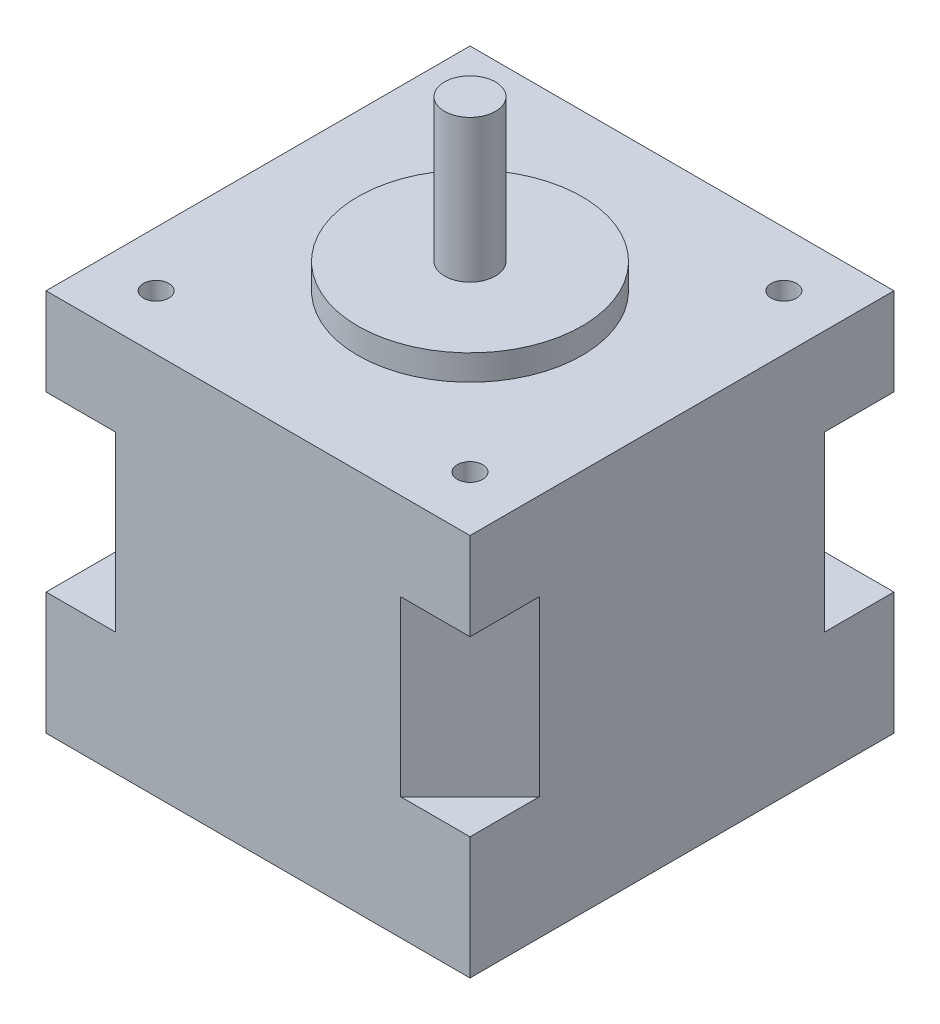
ISO-10303-21;
HEADER;
FILE_DESCRIPTION(('STEP AP214'),'2;1');
FILE_NAME('part.step','',(''),(''),'','','');
FILE_SCHEMA(('AUTOMOTIVE_DESIGN { 1 0 10303 214 1 1 1 1 }'));
ENDSEC;
DATA;
#1=APPLICATION_CONTEXT('core data for automotive mechanical design processes');
#2=APPLICATION_PROTOCOL_DEFINITION('international standard','automotive_design',2000,#1);
#3=PRODUCT_CONTEXT('',#1,'mechanical');
#4=PRODUCT('Part','Part','',(#3));
#5=PRODUCT_RELATED_PRODUCT_CATEGORY('part','',(#4));
#6=PRODUCT_DEFINITION_FORMATION('','',#4);
#7=PRODUCT_DEFINITION_CONTEXT('part definition',#1,'design');
#8=PRODUCT_DEFINITION('design','',#6,#7);
#9=PRODUCT_DEFINITION_SHAPE('','',#8);
#10=(LENGTH_UNIT() NAMED_UNIT(*) SI_UNIT(.MILLI.,.METRE.));
#11=(NAMED_UNIT(*) PLANE_ANGLE_UNIT() SI_UNIT($,.RADIAN.));
#12=(NAMED_UNIT(*) SI_UNIT($,.STERADIAN.) SOLID_ANGLE_UNIT());
#13=UNCERTAINTY_MEASURE_WITH_UNIT(LENGTH_MEASURE(1.E-05),#10,'distance_accuracy_value','');
#14=(GEOMETRIC_REPRESENTATION_CONTEXT(3) GLOBAL_UNCERTAINTY_ASSIGNED_CONTEXT((#13)) GLOBAL_UNIT_ASSIGNED_CONTEXT((#10,
#11,#12)) REPRESENTATION_CONTEXT('',''));
#15=CARTESIAN_POINT('',(0.,0.,0.));
#16=DIRECTION('',(0.,0.,1.));
#17=DIRECTION('',(1.,0.,0.));
#18=AXIS2_PLACEMENT_3D('',#15,#16,#17);
#19=CARTESIAN_POINT('',(20.8,37.6,-20.8));
#20=DIRECTION('',(-1.,0.,0.));
#21=DIRECTION('',(0.,0.,1.));
#22=AXIS2_PLACEMENT_3D('',#19,#20,#21);
#23=PLANE('',#22);
#24=DIRECTION('',(0.,-1.,0.));
#25=VECTOR('',#24,1.);
#26=CARTESIAN_POINT('',(20.8,37.6,20.8));
#27=LINE('',#26,#25);
#28=CARTESIAN_POINT('',(20.8,37.6,20.8));
#29=VERTEX_POINT('',#28);
#30=CARTESIAN_POINT('',(20.8,29.,20.8));
#31=VERTEX_POINT('',#30);
#32=EDGE_CURVE('E185',#29,#31,#27,.T.);
#33=ORIENTED_EDGE('',*,*,#32,.T.);
#34=DIRECTION('',(0.,0.,-1.));
#35=VECTOR('',#34,1.);
#36=CARTESIAN_POINT('',(20.8,29.,20.8));
#37=LINE('',#36,#35);
#38=CARTESIAN_POINT('',(20.8,29.,14.));
#39=VERTEX_POINT('',#38);
#40=EDGE_CURVE('E271',#31,#39,#37,.T.);
#41=ORIENTED_EDGE('',*,*,#40,.T.);
#42=DIRECTION('',(0.,-1.,0.));
#43=VECTOR('',#42,1.);
#44=CARTESIAN_POINT('',(20.8,29.,14.));
#45=LINE('',#44,#43);
#46=CARTESIAN_POINT('',(20.8,12.,14.));
#47=VERTEX_POINT('',#46);
#48=EDGE_CURVE('E256',#39,#47,#45,.T.);
#49=ORIENTED_EDGE('',*,*,#48,.T.);
#50=DIRECTION('',(0.,0.,-1.));
#51=VECTOR('',#50,1.);
#52=CARTESIAN_POINT('',(20.8,12.,20.8));
#53=LINE('',#52,#51);
#54=CARTESIAN_POINT('',(20.8,12.,20.8));
#55=VERTEX_POINT('',#54);
#56=EDGE_CURVE('E274',#55,#47,#53,.T.);
#57=ORIENTED_EDGE('',*,*,#56,.F.);
#58=CARTESIAN_POINT('',(20.8,0.,20.8));
#59=VERTEX_POINT('',#58);
#60=EDGE_CURVE('E188',#55,#59,#27,.T.);
#61=ORIENTED_EDGE('',*,*,#60,.T.);
#62=DIRECTION('',(0.,0.,-1.));
#63=VECTOR('',#62,1.);
#64=CARTESIAN_POINT('',(20.8,0.,-20.8));
#65=LINE('',#64,#63);
#66=CARTESIAN_POINT('',(20.8,0.,-20.8));
#67=VERTEX_POINT('',#66);
#68=EDGE_CURVE('E199',#59,#67,#65,.T.);
#69=ORIENTED_EDGE('',*,*,#68,.T.);
#70=DIRECTION('',(0.,-1.,0.));
#71=VECTOR('',#70,1.);
#72=CARTESIAN_POINT('',(20.8,37.6,-20.8));
#73=LINE('',#72,#71);
#74=CARTESIAN_POINT('',(20.8,12.,-20.8));
#75=VERTEX_POINT('',#74);
#76=EDGE_CURVE('E178',#75,#67,#73,.T.);
#77=ORIENTED_EDGE('',*,*,#76,.F.);
#78=DIRECTION('',(0.,0.,1.));
#79=VECTOR('',#78,1.);
#80=CARTESIAN_POINT('',(20.8,12.,-20.8));
#81=LINE('',#80,#79);
#82=CARTESIAN_POINT('',(20.8,12.,-14.));
#83=VERTEX_POINT('',#82);
#84=EDGE_CURVE('E253',#75,#83,#81,.T.);
#85=ORIENTED_EDGE('',*,*,#84,.T.);
#86=DIRECTION('',(0.,-1.,0.));
#87=VECTOR('',#86,1.);
#88=CARTESIAN_POINT('',(20.8,29.,-14.));
#89=LINE('',#88,#87);
#90=CARTESIAN_POINT('',(20.8,29.,-14.));
#91=VERTEX_POINT('',#90);
#92=EDGE_CURVE('E242',#91,#83,#89,.T.);
#93=ORIENTED_EDGE('',*,*,#92,.F.);
#94=DIRECTION('',(0.,0.,1.));
#95=VECTOR('',#94,1.);
#96=CARTESIAN_POINT('',(20.8,29.,-20.8));
#97=LINE('',#96,#95);
#98=CARTESIAN_POINT('',(20.8,29.,-20.8));
#99=VERTEX_POINT('',#98);
#100=EDGE_CURVE('E250',#99,#91,#97,.T.);
#101=ORIENTED_EDGE('',*,*,#100,.F.);
#102=CARTESIAN_POINT('',(20.8,37.6,-20.8));
#103=VERTEX_POINT('',#102);
#104=EDGE_CURVE('E41',#103,#99,#73,.T.);
#105=ORIENTED_EDGE('',*,*,#104,.F.);
#106=DIRECTION('',(0.,0.,-1.));
#107=VECTOR('',#106,1.);
#108=CARTESIAN_POINT('',(20.8,37.6,-20.8));
#109=LINE('',#108,#107);
#110=EDGE_CURVE('E192',#29,#103,#109,.T.);
#111=ORIENTED_EDGE('',*,*,#110,.F.);
#112=EDGE_LOOP('',(#33,#41,#49,#57,#61,#69,#77,#85,#93,#101,#105,#111));
#113=FACE_BOUND('',#112,.T.);
#114=ADVANCED_FACE('F38',(#113),#23,.F.);
#115=CARTESIAN_POINT('',(-20.8,37.6,-20.8));
#116=DIRECTION('',(0.,0.,1.));
#117=DIRECTION('',(1.,0.,0.));
#118=AXIS2_PLACEMENT_3D('',#115,#116,#117);
#119=PLANE('',#118);
#120=DIRECTION('',(0.,-1.,0.));
#121=VECTOR('',#120,1.);
#122=CARTESIAN_POINT('',(-14.,29.,-20.8));
#123=LINE('',#122,#121);
#124=CARTESIAN_POINT('',(-14.,29.,-20.8));
#125=VERTEX_POINT('',#124);
#126=CARTESIAN_POINT('',(-14.,12.,-20.8));
#127=VERTEX_POINT('',#126);
#128=EDGE_CURVE('E173',#125,#127,#123,.T.);
#129=ORIENTED_EDGE('',*,*,#128,.F.);
#130=DIRECTION('',(-1.,0.,0.));
#131=VECTOR('',#130,1.);
#132=CARTESIAN_POINT('',(-14.,29.,-20.8));
#133=LINE('',#132,#131);
#134=CARTESIAN_POINT('',(-20.8,29.,-20.8));
#135=VERTEX_POINT('',#134);
#136=EDGE_CURVE('E158',#125,#135,#133,.T.);
#137=ORIENTED_EDGE('',*,*,#136,.T.);
#138=DIRECTION('',(0.,-1.,0.));
#139=VECTOR('',#138,1.);
#140=CARTESIAN_POINT('',(-20.8,37.6,-20.8));
#141=LINE('',#140,#139);
#142=CARTESIAN_POINT('',(-20.8,37.6,-20.8));
#143=VERTEX_POINT('',#142);
#144=EDGE_CURVE('E170',#143,#135,#141,.T.);
#145=ORIENTED_EDGE('',*,*,#144,.F.);
#146=DIRECTION('',(-1.,0.,0.));
#147=VECTOR('',#146,1.);
#148=CARTESIAN_POINT('',(-20.8,37.6,-20.8));
#149=LINE('',#148,#147);
#150=EDGE_CURVE('E206',#103,#143,#149,.T.);
#151=ORIENTED_EDGE('',*,*,#150,.F.);
#152=ORIENTED_EDGE('',*,*,#104,.T.);
#153=DIRECTION('',(1.,0.,0.));
#154=VECTOR('',#153,1.);
#155=CARTESIAN_POINT('',(14.,29.,-20.8));
#156=LINE('',#155,#154);
#157=CARTESIAN_POINT('',(14.,29.,-20.8));
#158=VERTEX_POINT('',#157);
#159=EDGE_CURVE('E244',#158,#99,#156,.T.);
#160=ORIENTED_EDGE('',*,*,#159,.F.);
#161=DIRECTION('',(0.,-1.,0.));
#162=VECTOR('',#161,1.);
#163=CARTESIAN_POINT('',(14.,29.,-20.8));
#164=LINE('',#163,#162);
#165=CARTESIAN_POINT('',(14.,12.,-20.8));
#166=VERTEX_POINT('',#165);
#167=EDGE_CURVE('E239',#158,#166,#164,.T.);
#168=ORIENTED_EDGE('',*,*,#167,.T.);
#169=DIRECTION('',(1.,0.,0.));
#170=VECTOR('',#169,1.);
#171=CARTESIAN_POINT('',(14.,12.,-20.8));
#172=LINE('',#171,#170);
#173=EDGE_CURVE('E247',#166,#75,#172,.T.);
#174=ORIENTED_EDGE('',*,*,#173,.T.);
#175=ORIENTED_EDGE('',*,*,#76,.T.);
#176=DIRECTION('',(-1.,0.,0.));
#177=VECTOR('',#176,1.);
#178=CARTESIAN_POINT('',(-20.8,0.,-20.8));
#179=LINE('',#178,#177);
#180=CARTESIAN_POINT('',(-20.8,0.,-20.8));
#181=VERTEX_POINT('',#180);
#182=EDGE_CURVE('E196',#67,#181,#179,.T.);
#183=ORIENTED_EDGE('',*,*,#182,.T.);
#184=CARTESIAN_POINT('',(-20.8,12.,-20.8));
#185=VERTEX_POINT('',#184);
#186=EDGE_CURVE('E179',#185,#181,#141,.T.);
#187=ORIENTED_EDGE('',*,*,#186,.F.);
#188=DIRECTION('',(-1.,0.,0.));
#189=VECTOR('',#188,1.);
#190=CARTESIAN_POINT('',(-14.,12.,-20.8));
#191=LINE('',#190,#189);
#192=EDGE_CURVE('E54',#127,#185,#191,.T.);
#193=ORIENTED_EDGE('',*,*,#192,.F.);
#194=EDGE_LOOP('',(#129,#137,#145,#151,#152,#160,#168,#174,#175,#183,#187,#193));
#195=FACE_BOUND('',#194,.T.);
#196=ADVANCED_FACE('F169',(#195),#119,.F.);
#197=CARTESIAN_POINT('',(-20.8,37.6,-20.8));
#198=DIRECTION('',(1.,0.,0.));
#199=DIRECTION('',(0.,0.,-1.));
#200=AXIS2_PLACEMENT_3D('',#197,#198,#199);
#201=PLANE('',#200);
#202=ORIENTED_EDGE('',*,*,#144,.T.);
#203=DIRECTION('',(0.,0.,1.));
#204=VECTOR('',#203,1.);
#205=CARTESIAN_POINT('',(-20.8,29.,-20.8));
#206=LINE('',#205,#204);
#207=CARTESIAN_POINT('',(-20.8,29.,-14.));
#208=VERTEX_POINT('',#207);
#209=EDGE_CURVE('E155',#135,#208,#206,.T.);
#210=ORIENTED_EDGE('',*,*,#209,.T.);
#211=DIRECTION('',(0.,-1.,0.));
#212=VECTOR('',#211,1.);
#213=CARTESIAN_POINT('',(-20.8,29.,-14.));
#214=LINE('',#213,#212);
#215=CARTESIAN_POINT('',(-20.8,12.,-14.));
#216=VERTEX_POINT('',#215);
#217=EDGE_CURVE('E295',#208,#216,#214,.T.);
#218=ORIENTED_EDGE('',*,*,#217,.T.);
#219=DIRECTION('',(0.,0.,1.));
#220=VECTOR('',#219,1.);
#221=CARTESIAN_POINT('',(-20.8,12.,-20.8));
#222=LINE('',#221,#220);
#223=EDGE_CURVE('E306',#185,#216,#222,.T.);
#224=ORIENTED_EDGE('',*,*,#223,.F.);
#225=ORIENTED_EDGE('',*,*,#186,.T.);
#226=DIRECTION('',(0.,0.,1.));
#227=VECTOR('',#226,1.);
#228=CARTESIAN_POINT('',(-20.8,0.,-20.8));
#229=LINE('',#228,#227);
#230=CARTESIAN_POINT('',(-20.8,0.,20.8));
#231=VERTEX_POINT('',#230);
#232=EDGE_CURVE('E193',#181,#231,#229,.T.);
#233=ORIENTED_EDGE('',*,*,#232,.T.);
#234=DIRECTION('',(0.,-1.,0.));
#235=VECTOR('',#234,1.);
#236=CARTESIAN_POINT('',(-20.8,37.6,20.8));
#237=LINE('',#236,#235);
#238=CARTESIAN_POINT('',(-20.8,12.,20.8));
#239=VERTEX_POINT('',#238);
#240=EDGE_CURVE('E184',#239,#231,#237,.T.);
#241=ORIENTED_EDGE('',*,*,#240,.F.);
#242=DIRECTION('',(0.,0.,-1.));
#243=VECTOR('',#242,1.);
#244=CARTESIAN_POINT('',(-20.8,12.,20.8));
#245=LINE('',#244,#243);
#246=CARTESIAN_POINT('',(-20.8,12.,14.));
#247=VERTEX_POINT('',#246);
#248=EDGE_CURVE('E62',#239,#247,#245,.T.);
#249=ORIENTED_EDGE('',*,*,#248,.T.);
#250=DIRECTION('',(0.,-1.,0.));
#251=VECTOR('',#250,1.);
#252=CARTESIAN_POINT('',(-20.8,29.,14.));
#253=LINE('',#252,#251);
#254=CARTESIAN_POINT('',(-20.8,29.,14.));
#255=VERTEX_POINT('',#254);
#256=EDGE_CURVE('E284',#255,#247,#253,.T.);
#257=ORIENTED_EDGE('',*,*,#256,.F.);
#258=DIRECTION('',(0.,0.,-1.));
#259=VECTOR('',#258,1.);
#260=CARTESIAN_POINT('',(-20.8,29.,20.8));
#261=LINE('',#260,#259);
#262=CARTESIAN_POINT('',(-20.8,29.,20.8));
#263=VERTEX_POINT('',#262);
#264=EDGE_CURVE('E291',#263,#255,#261,.T.);
#265=ORIENTED_EDGE('',*,*,#264,.F.);
#266=CARTESIAN_POINT('',(-20.8,37.6,20.8));
#267=VERTEX_POINT('',#266);
#268=EDGE_CURVE('E180',#267,#263,#237,.T.);
#269=ORIENTED_EDGE('',*,*,#268,.F.);
#270=DIRECTION('',(0.,0.,1.));
#271=VECTOR('',#270,1.);
#272=CARTESIAN_POINT('',(-20.8,37.6,-20.8));
#273=LINE('',#272,#271);
#274=EDGE_CURVE('E177',#143,#267,#273,.T.);
#275=ORIENTED_EDGE('',*,*,#274,.F.);
#276=EDGE_LOOP('',(#202,#210,#218,#224,#225,#233,#241,#249,#257,#265,#269,#275));
#277=FACE_BOUND('',#276,.T.);
#278=ADVANCED_FACE('F175',(#277),#201,.F.);
#279=CARTESIAN_POINT('',(-20.8,37.6,20.8));
#280=DIRECTION('',(0.,0.,-1.));
#281=DIRECTION('',(-1.,0.,0.));
#282=AXIS2_PLACEMENT_3D('',#279,#280,#281);
#283=PLANE('',#282);
#284=ORIENTED_EDGE('',*,*,#268,.T.);
#285=DIRECTION('',(-1.,0.,0.));
#286=VECTOR('',#285,1.);
#287=CARTESIAN_POINT('',(-14.,29.,20.8));
#288=LINE('',#287,#286);
#289=CARTESIAN_POINT('',(-14.,29.,20.8));
#290=VERTEX_POINT('',#289);
#291=EDGE_CURVE('E286',#290,#263,#288,.T.);
#292=ORIENTED_EDGE('',*,*,#291,.F.);
#293=DIRECTION('',(0.,-1.,0.));
#294=VECTOR('',#293,1.);
#295=CARTESIAN_POINT('',(-14.,29.,20.8));
#296=LINE('',#295,#294);
#297=CARTESIAN_POINT('',(-14.,12.,20.8));
#298=VERTEX_POINT('',#297);
#299=EDGE_CURVE('E277',#290,#298,#296,.T.);
#300=ORIENTED_EDGE('',*,*,#299,.T.);
#301=DIRECTION('',(-1.,0.,0.));
#302=VECTOR('',#301,1.);
#303=CARTESIAN_POINT('',(-14.,12.,20.8));
#304=LINE('',#303,#302);
#305=EDGE_CURVE('E289',#298,#239,#304,.T.);
#306=ORIENTED_EDGE('',*,*,#305,.T.);
#307=ORIENTED_EDGE('',*,*,#240,.T.);
#308=DIRECTION('',(1.,0.,0.));
#309=VECTOR('',#308,1.);
#310=CARTESIAN_POINT('',(-20.8,0.,20.8));
#311=LINE('',#310,#309);
#312=EDGE_CURVE('E189',#231,#59,#311,.T.);
#313=ORIENTED_EDGE('',*,*,#312,.T.);
#314=ORIENTED_EDGE('',*,*,#60,.F.);
#315=DIRECTION('',(1.,0.,0.));
#316=VECTOR('',#315,1.);
#317=CARTESIAN_POINT('',(14.,12.,20.8));
#318=LINE('',#317,#316);
#319=CARTESIAN_POINT('',(14.,12.,20.8));
#320=VERTEX_POINT('',#319);
#321=EDGE_CURVE('E272',#320,#55,#318,.T.);
#322=ORIENTED_EDGE('',*,*,#321,.F.);
#323=DIRECTION('',(0.,-1.,0.));
#324=VECTOR('',#323,1.);
#325=CARTESIAN_POINT('',(14.,29.,20.8));
#326=LINE('',#325,#324);
#327=CARTESIAN_POINT('',(14.,29.,20.8));
#328=VERTEX_POINT('',#327);
#329=EDGE_CURVE('E263',#328,#320,#326,.T.);
#330=ORIENTED_EDGE('',*,*,#329,.F.);
#331=DIRECTION('',(1.,0.,0.));
#332=VECTOR('',#331,1.);
#333=CARTESIAN_POINT('',(14.,29.,20.8));
#334=LINE('',#333,#332);
#335=EDGE_CURVE('E279',#328,#31,#334,.T.);
#336=ORIENTED_EDGE('',*,*,#335,.T.);
#337=ORIENTED_EDGE('',*,*,#32,.F.);
#338=DIRECTION('',(1.,0.,0.));
#339=VECTOR('',#338,1.);
#340=CARTESIAN_POINT('',(-20.8,37.6,20.8));
#341=LINE('',#340,#339);
#342=EDGE_CURVE('E203',#267,#29,#341,.T.);
#343=ORIENTED_EDGE('',*,*,#342,.F.);
#344=EDGE_LOOP('',(#284,#292,#300,#306,#307,#313,#314,#322,#330,#336,#337,#343));
#345=FACE_BOUND('',#344,.T.);
#346=ADVANCED_FACE('F341',(#345),#283,.F.);
#347=CARTESIAN_POINT('',(0.,37.6,0.));
#348=DIRECTION('',(0.,1.,0.));
#349=DIRECTION('',(0.,0.,1.));
#350=AXIS2_PLACEMENT_3D('',#347,#348,#349);
#351=PLANE('',#350);
#352=CARTESIAN_POINT('',(15.4,37.6,15.4));
#353=DIRECTION('',(0.,-1.,0.));
#354=DIRECTION('',(0.,0.,-1.));
#355=AXIS2_PLACEMENT_3D('',#352,#353,#354);
#356=CIRCLE('',#355,1.25);
#357=CARTESIAN_POINT('',(15.4,37.6,14.15));
#358=VERTEX_POINT('',#357);
#359=EDGE_CURVE('E236',#358,#358,#356,.T.);
#360=ORIENTED_EDGE('',*,*,#359,.T.);
#361=EDGE_LOOP('',(#360));
#362=FACE_BOUND('',#361,.T.);
#363=CARTESIAN_POINT('',(-15.4,37.6,15.4));
#364=DIRECTION('',(0.,1.,0.));
#365=DIRECTION('',(0.,0.,-1.));
#366=AXIS2_PLACEMENT_3D('',#363,#364,#365);
#367=CIRCLE('',#366,1.25);
#368=CARTESIAN_POINT('',(-15.4,37.6,14.15));
#369=VERTEX_POINT('',#368);
#370=EDGE_CURVE('E230',#369,#369,#367,.T.);
#371=ORIENTED_EDGE('',*,*,#370,.F.);
#372=EDGE_LOOP('',(#371));
#373=FACE_BOUND('',#372,.T.);
#374=CARTESIAN_POINT('',(-15.4,37.6,-15.4));
#375=DIRECTION('',(0.,-1.,0.));
#376=DIRECTION('',(0.,0.,1.));
#377=AXIS2_PLACEMENT_3D('',#374,#375,#376);
#378=CIRCLE('',#377,1.25);
#379=CARTESIAN_POINT('',(-15.4,37.6,-14.15));
#380=VERTEX_POINT('',#379);
#381=EDGE_CURVE('E224',#380,#380,#378,.T.);
#382=ORIENTED_EDGE('',*,*,#381,.T.);
#383=EDGE_LOOP('',(#382));
#384=FACE_BOUND('',#383,.T.);
#385=CARTESIAN_POINT('',(15.4,37.6,-15.4));
#386=DIRECTION('',(0.,1.,0.));
#387=DIRECTION('',(0.,0.,1.));
#388=AXIS2_PLACEMENT_3D('',#385,#386,#387);
#389=CIRCLE('',#388,1.25);
#390=CARTESIAN_POINT('',(15.4,37.6,-14.15));
#391=VERTEX_POINT('',#390);
#392=EDGE_CURVE('E218',#391,#391,#389,.T.);
#393=ORIENTED_EDGE('',*,*,#392,.F.);
#394=EDGE_LOOP('',(#393));
#395=FACE_BOUND('',#394,.T.);
#396=CARTESIAN_POINT('',(0.,37.6,0.));
#397=DIRECTION('',(0.,1.,0.));
#398=DIRECTION('',(0.,0.,1.));
#399=AXIS2_PLACEMENT_3D('',#396,#397,#398);
#400=CIRCLE('',#399,11.);
#401=CARTESIAN_POINT('',(0.,37.6,11.));
#402=VERTEX_POINT('',#401);
#403=EDGE_CURVE('E46',#402,#402,#400,.T.);
#404=ORIENTED_EDGE('',*,*,#403,.F.);
#405=EDGE_LOOP('',(#404));
#406=FACE_BOUND('',#405,.T.);
#407=ORIENTED_EDGE('',*,*,#110,.T.);
#408=ORIENTED_EDGE('',*,*,#150,.T.);
#409=ORIENTED_EDGE('',*,*,#274,.T.);
#410=ORIENTED_EDGE('',*,*,#342,.T.);
#411=EDGE_LOOP('',(#407,#408,#409,#410));
#412=FACE_BOUND('',#411,.T.);
#413=ADVANCED_FACE('F329',(#362,#373,#384,#395,#406,#412),#351,.T.);
#414=CARTESIAN_POINT('',(0.,0.,0.));
#415=DIRECTION('',(0.,1.,0.));
#416=DIRECTION('',(0.,0.,1.));
#417=AXIS2_PLACEMENT_3D('',#414,#415,#416);
#418=PLANE('',#417);
#419=CARTESIAN_POINT('',(0.,0.,0.));
#420=DIRECTION('',(0.,-1.,0.));
#421=DIRECTION('',(0.,0.,-1.));
#422=AXIS2_PLACEMENT_3D('',#419,#420,#421);
#423=CIRCLE('',#422,4.3);
#424=CARTESIAN_POINT('',(0.,0.,-4.3));
#425=VERTEX_POINT('',#424);
#426=EDGE_CURVE('E310',#425,#425,#423,.T.);
#427=ORIENTED_EDGE('',*,*,#426,.F.);
#428=EDGE_LOOP('',(#427));
#429=FACE_BOUND('',#428,.T.);
#430=ORIENTED_EDGE('',*,*,#68,.F.);
#431=ORIENTED_EDGE('',*,*,#312,.F.);
#432=ORIENTED_EDGE('',*,*,#232,.F.);
#433=ORIENTED_EDGE('',*,*,#182,.F.);
#434=EDGE_LOOP('',(#430,#431,#432,#433));
#435=FACE_BOUND('',#434,.T.);
#436=ADVANCED_FACE('F325',(#429,#435),#418,.F.);
#437=CARTESIAN_POINT('',(0.,40.1,0.));
#438=DIRECTION('',(0.,-1.,0.));
#439=DIRECTION('',(0.,0.,-1.));
#440=AXIS2_PLACEMENT_3D('',#437,#438,#439);
#441=CYLINDRICAL_SURFACE('',#440,11.);
#442=CARTESIAN_POINT('',(0.,40.1,0.));
#443=DIRECTION('',(0.,1.,0.));
#444=DIRECTION('',(0.,0.,1.));
#445=AXIS2_PLACEMENT_3D('',#442,#443,#444);
#446=CIRCLE('',#445,11.);
#447=CARTESIAN_POINT('',(0.,40.1,11.));
#448=VERTEX_POINT('',#447);
#449=EDGE_CURVE('E202',#448,#448,#446,.T.);
#450=ORIENTED_EDGE('',*,*,#449,.F.);
#451=EDGE_LOOP('',(#450));
#452=FACE_BOUND('',#451,.T.);
#453=ORIENTED_EDGE('',*,*,#403,.T.);
#454=EDGE_LOOP('',(#453));
#455=FACE_BOUND('',#454,.T.);
#456=ADVANCED_FACE('F328',(#452,#455),#441,.T.);
#457=CARTESIAN_POINT('',(0.,40.1,0.));
#458=DIRECTION('',(0.,1.,0.));
#459=DIRECTION('',(0.,0.,1.));
#460=AXIS2_PLACEMENT_3D('',#457,#458,#459);
#461=PLANE('',#460);
#462=CARTESIAN_POINT('',(0.,40.1,0.));
#463=DIRECTION('',(0.,1.,0.));
#464=DIRECTION('',(0.,0.,1.));
#465=AXIS2_PLACEMENT_3D('',#462,#463,#464);
#466=CIRCLE('',#465,2.5);
#467=CARTESIAN_POINT('',(0.,40.1,2.5));
#468=VERTEX_POINT('',#467);
#469=EDGE_CURVE('E11',#468,#468,#466,.T.);
#470=ORIENTED_EDGE('',*,*,#469,.F.);
#471=EDGE_LOOP('',(#470));
#472=FACE_BOUND('',#471,.T.);
#473=ORIENTED_EDGE('',*,*,#449,.T.);
#474=EDGE_LOOP('',(#473));
#475=FACE_BOUND('',#474,.T.);
#476=ADVANCED_FACE('F398',(#472,#475),#461,.T.);
#477=CARTESIAN_POINT('',(0.,54.1,0.));
#478=DIRECTION('',(0.,-1.,0.));
#479=DIRECTION('',(0.,0.,-1.));
#480=AXIS2_PLACEMENT_3D('',#477,#478,#479);
#481=CYLINDRICAL_SURFACE('',#480,2.5);
#482=CARTESIAN_POINT('',(0.,54.1,0.));
#483=DIRECTION('',(0.,1.,0.));
#484=DIRECTION('',(0.,0.,1.));
#485=AXIS2_PLACEMENT_3D('',#482,#483,#484);
#486=CIRCLE('',#485,2.5);
#487=CARTESIAN_POINT('',(0.,54.1,2.5));
#488=VERTEX_POINT('',#487);
#489=EDGE_CURVE('E213',#488,#488,#486,.T.);
#490=ORIENTED_EDGE('',*,*,#489,.F.);
#491=EDGE_LOOP('',(#490));
#492=FACE_BOUND('',#491,.T.);
#493=ORIENTED_EDGE('',*,*,#469,.T.);
#494=EDGE_LOOP('',(#493));
#495=FACE_BOUND('',#494,.T.);
#496=ADVANCED_FACE('F402',(#492,#495),#481,.T.);
#497=CARTESIAN_POINT('',(0.,54.1,0.));
#498=DIRECTION('',(0.,1.,0.));
#499=DIRECTION('',(0.,0.,1.));
#500=AXIS2_PLACEMENT_3D('',#497,#498,#499);
#501=PLANE('',#500);
#502=ORIENTED_EDGE('',*,*,#489,.T.);
#503=EDGE_LOOP('',(#502));
#504=FACE_BOUND('',#503,.T.);
#505=ADVANCED_FACE('F406',(#504),#501,.T.);
#506=CARTESIAN_POINT('',(15.4,29.6,-15.4));
#507=DIRECTION('',(0.,1.,0.));
#508=DIRECTION('',(0.,0.,1.));
#509=AXIS2_PLACEMENT_3D('',#506,#507,#508);
#510=CYLINDRICAL_SURFACE('',#509,1.25);
#511=CARTESIAN_POINT('',(15.4,29.6,-15.4));
#512=DIRECTION('',(0.,1.,0.));
#513=DIRECTION('',(0.,0.,1.));
#514=AXIS2_PLACEMENT_3D('',#511,#512,#513);
#515=CIRCLE('',#514,1.25);
#516=CARTESIAN_POINT('',(15.4,29.6,-14.15));
#517=VERTEX_POINT('',#516);
#518=EDGE_CURVE('E217',#517,#517,#515,.T.);
#519=ORIENTED_EDGE('',*,*,#518,.F.);
#520=EDGE_LOOP('',(#519));
#521=FACE_BOUND('',#520,.T.);
#522=ORIENTED_EDGE('',*,*,#392,.T.);
#523=EDGE_LOOP('',(#522));
#524=FACE_BOUND('',#523,.T.);
#525=ADVANCED_FACE('F410',(#521,#524),#510,.F.);
#526=CARTESIAN_POINT('',(15.4,29.6,-15.4));
#527=DIRECTION('',(0.,1.,0.));
#528=DIRECTION('',(0.,0.,1.));
#529=AXIS2_PLACEMENT_3D('',#526,#527,#528);
#530=PLANE('',#529);
#531=ORIENTED_EDGE('',*,*,#518,.T.);
#532=EDGE_LOOP('',(#531));
#533=FACE_BOUND('',#532,.T.);
#534=ADVANCED_FACE('F414',(#533),#530,.T.);
#535=CARTESIAN_POINT('',(-15.4,29.6,-15.4));
#536=DIRECTION('',(0.,1.,0.));
#537=DIRECTION('',(0.,0.,1.));
#538=AXIS2_PLACEMENT_3D('',#535,#536,#537);
#539=CYLINDRICAL_SURFACE('',#538,1.25);
#540=CARTESIAN_POINT('',(-15.4,29.6,-15.4));
#541=DIRECTION('',(0.,-1.,0.));
#542=DIRECTION('',(0.,0.,1.));
#543=AXIS2_PLACEMENT_3D('',#540,#541,#542);
#544=CIRCLE('',#543,1.25);
#545=CARTESIAN_POINT('',(-15.4,29.6,-14.15));
#546=VERTEX_POINT('',#545);
#547=EDGE_CURVE('E221',#546,#546,#544,.T.);
#548=ORIENTED_EDGE('',*,*,#547,.T.);
#549=EDGE_LOOP('',(#548));
#550=FACE_BOUND('',#549,.T.);
#551=ORIENTED_EDGE('',*,*,#381,.F.);
#552=EDGE_LOOP('',(#551));
#553=FACE_BOUND('',#552,.T.);
#554=ADVANCED_FACE('F418',(#550,#553),#539,.F.);
#555=CARTESIAN_POINT('',(-15.4,29.6,-15.4));
#556=DIRECTION('',(0.,1.,0.));
#557=DIRECTION('',(0.,0.,1.));
#558=AXIS2_PLACEMENT_3D('',#555,#556,#557);
#559=PLANE('',#558);
#560=ORIENTED_EDGE('',*,*,#547,.F.);
#561=EDGE_LOOP('',(#560));
#562=FACE_BOUND('',#561,.T.);
#563=ADVANCED_FACE('F422',(#562),#559,.T.);
#564=CARTESIAN_POINT('',(-15.4,29.6,15.4));
#565=DIRECTION('',(0.,1.,0.));
#566=DIRECTION('',(0.,0.,1.));
#567=AXIS2_PLACEMENT_3D('',#564,#565,#566);
#568=CYLINDRICAL_SURFACE('',#567,1.25);
#569=CARTESIAN_POINT('',(-15.4,29.6,15.4));
#570=DIRECTION('',(0.,1.,0.));
#571=DIRECTION('',(0.,0.,-1.));
#572=AXIS2_PLACEMENT_3D('',#569,#570,#571);
#573=CIRCLE('',#572,1.25);
#574=CARTESIAN_POINT('',(-15.4,29.6,14.15));
#575=VERTEX_POINT('',#574);
#576=EDGE_CURVE('E227',#575,#575,#573,.T.);
#577=ORIENTED_EDGE('',*,*,#576,.F.);
#578=EDGE_LOOP('',(#577));
#579=FACE_BOUND('',#578,.T.);
#580=ORIENTED_EDGE('',*,*,#370,.T.);
#581=EDGE_LOOP('',(#580));
#582=FACE_BOUND('',#581,.T.);
#583=ADVANCED_FACE('F426',(#579,#582),#568,.F.);
#584=CARTESIAN_POINT('',(-15.4,29.6,15.4));
#585=DIRECTION('',(0.,1.,0.));
#586=DIRECTION('',(0.,0.,-1.));
#587=AXIS2_PLACEMENT_3D('',#584,#585,#586);
#588=PLANE('',#587);
#589=ORIENTED_EDGE('',*,*,#576,.T.);
#590=EDGE_LOOP('',(#589));
#591=FACE_BOUND('',#590,.T.);
#592=ADVANCED_FACE('F430',(#591),#588,.T.);
#593=CARTESIAN_POINT('',(15.4,29.6,15.4));
#594=DIRECTION('',(0.,1.,0.));
#595=DIRECTION('',(0.,0.,1.));
#596=AXIS2_PLACEMENT_3D('',#593,#594,#595);
#597=CYLINDRICAL_SURFACE('',#596,1.25);
#598=CARTESIAN_POINT('',(15.4,29.6,15.4));
#599=DIRECTION('',(0.,-1.,0.));
#600=DIRECTION('',(0.,0.,-1.));
#601=AXIS2_PLACEMENT_3D('',#598,#599,#600);
#602=CIRCLE('',#601,1.25);
#603=CARTESIAN_POINT('',(15.4,29.6,14.15));
#604=VERTEX_POINT('',#603);
#605=EDGE_CURVE('E233',#604,#604,#602,.T.);
#606=ORIENTED_EDGE('',*,*,#605,.T.);
#607=EDGE_LOOP('',(#606));
#608=FACE_BOUND('',#607,.T.);
#609=ORIENTED_EDGE('',*,*,#359,.F.);
#610=EDGE_LOOP('',(#609));
#611=FACE_BOUND('',#610,.T.);
#612=ADVANCED_FACE('F434',(#608,#611),#597,.F.);
#613=CARTESIAN_POINT('',(15.4,29.6,15.4));
#614=DIRECTION('',(0.,1.,0.));
#615=DIRECTION('',(0.,0.,-1.));
#616=AXIS2_PLACEMENT_3D('',#613,#614,#615);
#617=PLANE('',#616);
#618=ORIENTED_EDGE('',*,*,#605,.F.);
#619=EDGE_LOOP('',(#618));
#620=FACE_BOUND('',#619,.T.);
#621=ADVANCED_FACE('F438',(#620),#617,.T.);
#622=CARTESIAN_POINT('',(20.8,29.,-14.));
#623=DIRECTION('',(-0.707106781186548,0.,0.707106781186547));
#624=DIRECTION('',(0.707106781186547,0.,0.707106781186548));
#625=AXIS2_PLACEMENT_3D('',#622,#623,#624);
#626=PLANE('',#625);
#627=DIRECTION('',(-0.707106781186547,0.,-0.707106781186548));
#628=VECTOR('',#627,1.);
#629=CARTESIAN_POINT('',(20.8,12.,-14.));
#630=LINE('',#629,#628);
#631=EDGE_CURVE('E251',#83,#166,#630,.T.);
#632=ORIENTED_EDGE('',*,*,#631,.T.);
#633=ORIENTED_EDGE('',*,*,#167,.F.);
#634=DIRECTION('',(-0.707106781186547,0.,-0.707106781186548));
#635=VECTOR('',#634,1.);
#636=CARTESIAN_POINT('',(20.8,29.,-14.));
#637=LINE('',#636,#635);
#638=EDGE_CURVE('E258',#91,#158,#637,.T.);
#639=ORIENTED_EDGE('',*,*,#638,.F.);
#640=ORIENTED_EDGE('',*,*,#92,.T.);
#641=EDGE_LOOP('',(#632,#633,#639,#640));
#642=FACE_BOUND('',#641,.T.);
#643=ADVANCED_FACE('F354',(#642),#626,.F.);
#644=CARTESIAN_POINT('',(0.,29.,0.));
#645=DIRECTION('',(0.,1.,0.));
#646=DIRECTION('',(0.,0.,1.));
#647=AXIS2_PLACEMENT_3D('',#644,#645,#646);
#648=PLANE('',#647);
#649=ORIENTED_EDGE('',*,*,#100,.T.);
#650=ORIENTED_EDGE('',*,*,#638,.T.);
#651=ORIENTED_EDGE('',*,*,#159,.T.);
#652=EDGE_LOOP('',(#649,#650,#651));
#653=FACE_BOUND('',#652,.T.);
#654=ADVANCED_FACE('F356',(#653),#648,.F.);
#655=CARTESIAN_POINT('',(0.,12.,0.));
#656=DIRECTION('',(0.,1.,0.));
#657=DIRECTION('',(0.,0.,1.));
#658=AXIS2_PLACEMENT_3D('',#655,#656,#657);
#659=PLANE('',#658);
#660=ORIENTED_EDGE('',*,*,#84,.F.);
#661=ORIENTED_EDGE('',*,*,#173,.F.);
#662=ORIENTED_EDGE('',*,*,#631,.F.);
#663=EDGE_LOOP('',(#660,#661,#662));
#664=FACE_BOUND('',#663,.T.);
#665=ADVANCED_FACE('F348',(#664),#659,.T.);
#666=CARTESIAN_POINT('',(20.8,29.,14.));
#667=DIRECTION('',(0.707106781186548,0.,0.707106781186547));
#668=DIRECTION('',(0.707106781186547,0.,-0.707106781186548));
#669=AXIS2_PLACEMENT_3D('',#666,#667,#668);
#670=PLANE('',#669);
#671=DIRECTION('',(-0.707106781186547,0.,0.707106781186548));
#672=VECTOR('',#671,1.);
#673=CARTESIAN_POINT('',(20.8,12.,14.));
#674=LINE('',#673,#672);
#675=EDGE_CURVE('E268',#47,#320,#674,.T.);
#676=ORIENTED_EDGE('',*,*,#675,.F.);
#677=ORIENTED_EDGE('',*,*,#48,.F.);
#678=DIRECTION('',(-0.707106781186547,0.,0.707106781186548));
#679=VECTOR('',#678,1.);
#680=CARTESIAN_POINT('',(20.8,29.,14.));
#681=LINE('',#680,#679);
#682=EDGE_CURVE('E265',#39,#328,#681,.T.);
#683=ORIENTED_EDGE('',*,*,#682,.T.);
#684=ORIENTED_EDGE('',*,*,#329,.T.);
#685=EDGE_LOOP('',(#676,#677,#683,#684));
#686=FACE_BOUND('',#685,.T.);
#687=ADVANCED_FACE('F367',(#686),#670,.T.);
#688=CARTESIAN_POINT('',(0.,29.,0.));
#689=DIRECTION('',(0.,1.,0.));
#690=DIRECTION('',(0.,0.,-1.));
#691=AXIS2_PLACEMENT_3D('',#688,#689,#690);
#692=PLANE('',#691);
#693=ORIENTED_EDGE('',*,*,#40,.F.);
#694=ORIENTED_EDGE('',*,*,#335,.F.);
#695=ORIENTED_EDGE('',*,*,#682,.F.);
#696=EDGE_LOOP('',(#693,#694,#695));
#697=FACE_BOUND('',#696,.T.);
#698=ADVANCED_FACE('F364',(#697),#692,.F.);
#699=CARTESIAN_POINT('',(0.,12.,0.));
#700=DIRECTION('',(0.,1.,0.));
#701=DIRECTION('',(0.,0.,-1.));
#702=AXIS2_PLACEMENT_3D('',#699,#700,#701);
#703=PLANE('',#702);
#704=ORIENTED_EDGE('',*,*,#56,.T.);
#705=ORIENTED_EDGE('',*,*,#675,.T.);
#706=ORIENTED_EDGE('',*,*,#321,.T.);
#707=EDGE_LOOP('',(#704,#705,#706));
#708=FACE_BOUND('',#707,.T.);
#709=ADVANCED_FACE('F369',(#708),#703,.T.);
#710=CARTESIAN_POINT('',(-20.8,29.,14.));
#711=DIRECTION('',(0.707106781186548,0.,-0.707106781186547));
#712=DIRECTION('',(-0.707106781186547,0.,-0.707106781186548));
#713=AXIS2_PLACEMENT_3D('',#710,#711,#712);
#714=PLANE('',#713);
#715=DIRECTION('',(0.707106781186547,0.,0.707106781186548));
#716=VECTOR('',#715,1.);
#717=CARTESIAN_POINT('',(-20.8,12.,14.));
#718=LINE('',#717,#716);
#719=EDGE_CURVE('E292',#247,#298,#718,.T.);
#720=ORIENTED_EDGE('',*,*,#719,.T.);
#721=ORIENTED_EDGE('',*,*,#299,.F.);
#722=DIRECTION('',(0.707106781186547,0.,0.707106781186548));
#723=VECTOR('',#722,1.);
#724=CARTESIAN_POINT('',(-20.8,29.,14.));
#725=LINE('',#724,#723);
#726=EDGE_CURVE('E297',#255,#290,#725,.T.);
#727=ORIENTED_EDGE('',*,*,#726,.F.);
#728=ORIENTED_EDGE('',*,*,#256,.T.);
#729=EDGE_LOOP('',(#720,#721,#727,#728));
#730=FACE_BOUND('',#729,.T.);
#731=ADVANCED_FACE('F371',(#730),#714,.F.);
#732=CARTESIAN_POINT('',(0.,29.,0.));
#733=DIRECTION('',(0.,1.,0.));
#734=DIRECTION('',(0.,0.,-1.));
#735=AXIS2_PLACEMENT_3D('',#732,#733,#734);
#736=PLANE('',#735);
#737=ORIENTED_EDGE('',*,*,#264,.T.);
#738=ORIENTED_EDGE('',*,*,#726,.T.);
#739=ORIENTED_EDGE('',*,*,#291,.T.);
#740=EDGE_LOOP('',(#737,#738,#739));
#741=FACE_BOUND('',#740,.T.);
#742=ADVANCED_FACE('F377',(#741),#736,.F.);
#743=CARTESIAN_POINT('',(0.,12.,0.));
#744=DIRECTION('',(0.,1.,0.));
#745=DIRECTION('',(0.,0.,-1.));
#746=AXIS2_PLACEMENT_3D('',#743,#744,#745);
#747=PLANE('',#746);
#748=ORIENTED_EDGE('',*,*,#248,.F.);
#749=ORIENTED_EDGE('',*,*,#305,.F.);
#750=ORIENTED_EDGE('',*,*,#719,.F.);
#751=EDGE_LOOP('',(#748,#749,#750));
#752=FACE_BOUND('',#751,.T.);
#753=ADVANCED_FACE('F475',(#752),#747,.T.);
#754=CARTESIAN_POINT('',(-20.8,29.,-14.));
#755=DIRECTION('',(-0.707106781186548,0.,-0.707106781186547));
#756=DIRECTION('',(-0.707106781186547,0.,0.707106781186548));
#757=AXIS2_PLACEMENT_3D('',#754,#755,#756);
#758=PLANE('',#757);
#759=DIRECTION('',(0.707106781186547,0.,-0.707106781186548));
#760=VECTOR('',#759,1.);
#761=CARTESIAN_POINT('',(-20.8,12.,-14.));
#762=LINE('',#761,#760);
#763=EDGE_CURVE('E165',#216,#127,#762,.T.);
#764=ORIENTED_EDGE('',*,*,#763,.F.);
#765=ORIENTED_EDGE('',*,*,#217,.F.);
#766=DIRECTION('',(0.707106781186547,0.,-0.707106781186548));
#767=VECTOR('',#766,1.);
#768=CARTESIAN_POINT('',(-20.8,29.,-14.));
#769=LINE('',#768,#767);
#770=EDGE_CURVE('E160',#208,#125,#769,.T.);
#771=ORIENTED_EDGE('',*,*,#770,.T.);
#772=ORIENTED_EDGE('',*,*,#128,.T.);
#773=EDGE_LOOP('',(#764,#765,#771,#772));
#774=FACE_BOUND('',#773,.T.);
#775=ADVANCED_FACE('F485',(#774),#758,.T.);
#776=CARTESIAN_POINT('',(0.,29.,0.));
#777=DIRECTION('',(0.,1.,0.));
#778=DIRECTION('',(0.,0.,1.));
#779=AXIS2_PLACEMENT_3D('',#776,#777,#778);
#780=PLANE('',#779);
#781=ORIENTED_EDGE('',*,*,#209,.F.);
#782=ORIENTED_EDGE('',*,*,#136,.F.);
#783=ORIENTED_EDGE('',*,*,#770,.F.);
#784=EDGE_LOOP('',(#781,#782,#783));
#785=FACE_BOUND('',#784,.T.);
#786=ADVANCED_FACE('F157',(#785),#780,.F.);
#787=CARTESIAN_POINT('',(0.,12.,0.));
#788=DIRECTION('',(0.,1.,0.));
#789=DIRECTION('',(0.,0.,1.));
#790=AXIS2_PLACEMENT_3D('',#787,#788,#789);
#791=PLANE('',#790);
#792=ORIENTED_EDGE('',*,*,#223,.T.);
#793=ORIENTED_EDGE('',*,*,#763,.T.);
#794=ORIENTED_EDGE('',*,*,#192,.T.);
#795=EDGE_LOOP('',(#792,#793,#794));
#796=FACE_BOUND('',#795,.T.);
#797=ADVANCED_FACE('F321',(#796),#791,.T.);
#798=CARTESIAN_POINT('',(0.,5.7,0.));
#799=DIRECTION('',(0.,-1.,0.));
#800=DIRECTION('',(0.,0.,-1.));
#801=AXIS2_PLACEMENT_3D('',#798,#799,#800);
#802=CYLINDRICAL_SURFACE('',#801,4.3);
#803=CARTESIAN_POINT('',(0.,5.7,0.));
#804=DIRECTION('',(0.,-1.,0.));
#805=DIRECTION('',(0.,0.,-1.));
#806=AXIS2_PLACEMENT_3D('',#803,#804,#805);
#807=CIRCLE('',#806,4.3);
#808=CARTESIAN_POINT('',(0.,5.7,-4.3));
#809=VERTEX_POINT('',#808);
#810=EDGE_CURVE('E308',#809,#809,#807,.T.);
#811=ORIENTED_EDGE('',*,*,#810,.F.);
#812=EDGE_LOOP('',(#811));
#813=FACE_BOUND('',#812,.T.);
#814=ORIENTED_EDGE('',*,*,#426,.T.);
#815=EDGE_LOOP('',(#814));
#816=FACE_BOUND('',#815,.T.);
#817=ADVANCED_FACE('F318',(#813,#816),#802,.F.);
#818=CARTESIAN_POINT('',(0.,5.7,0.));
#819=DIRECTION('',(0.,-1.,0.));
#820=DIRECTION('',(0.,0.,-1.));
#821=AXIS2_PLACEMENT_3D('',#818,#819,#820);
#822=PLANE('',#821);
#823=ORIENTED_EDGE('',*,*,#810,.T.);
#824=EDGE_LOOP('',(#823));
#825=FACE_BOUND('',#824,.T.);
#826=ADVANCED_FACE('F316',(#825),#822,.T.);
#827=CLOSED_SHELL('',(#114,#196,#278,#346,#413,#436,#456,#476,#496,#505,#525,#534,#554,#563,
#583,#592,#612,#621,#643,#654,#665,#687,#698,#709,#731,#742,#753,#775,#786,#797,#817,#826));
#828=MANIFOLD_SOLID_BREP('B2',#827);
#829=ADVANCED_BREP_SHAPE_REPRESENTATION('',(#18,#828),#14);
#830=SHAPE_DEFINITION_REPRESENTATION(#9,#829);
ENDSEC;
END-ISO-10303-21;
